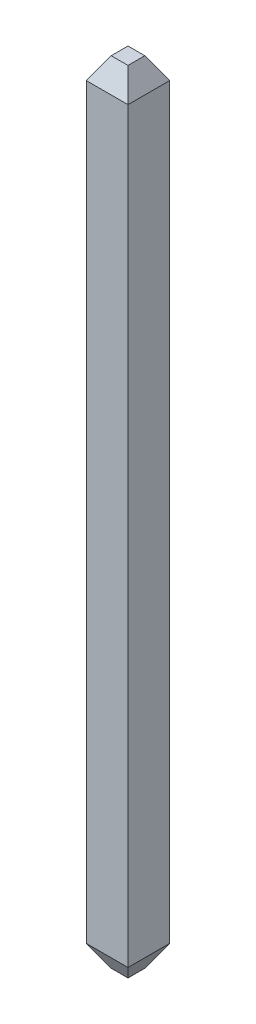
ISO-10303-21;
HEADER;
FILE_DESCRIPTION(('STEP AP214'),'2;1');
FILE_NAME('part.step','',(''),(''),'','','');
FILE_SCHEMA(('AUTOMOTIVE_DESIGN { 1 0 10303 214 1 1 1 1 }'));
ENDSEC;
DATA;
#1=APPLICATION_CONTEXT('core data for automotive mechanical design processes');
#2=APPLICATION_PROTOCOL_DEFINITION('international standard','automotive_design',2000,#1);
#3=PRODUCT_CONTEXT('',#1,'mechanical');
#4=PRODUCT('Part','Part','',(#3));
#5=PRODUCT_RELATED_PRODUCT_CATEGORY('part','',(#4));
#6=PRODUCT_DEFINITION_FORMATION('','',#4);
#7=PRODUCT_DEFINITION_CONTEXT('part definition',#1,'design');
#8=PRODUCT_DEFINITION('design','',#6,#7);
#9=PRODUCT_DEFINITION_SHAPE('','',#8);
#10=(LENGTH_UNIT() NAMED_UNIT(*) SI_UNIT(.MILLI.,.METRE.));
#11=(NAMED_UNIT(*) PLANE_ANGLE_UNIT() SI_UNIT($,.RADIAN.));
#12=(NAMED_UNIT(*) SI_UNIT($,.STERADIAN.) SOLID_ANGLE_UNIT());
#13=UNCERTAINTY_MEASURE_WITH_UNIT(LENGTH_MEASURE(1.E-05),#10,'distance_accuracy_value','');
#14=(GEOMETRIC_REPRESENTATION_CONTEXT(3) GLOBAL_UNCERTAINTY_ASSIGNED_CONTEXT((#13)) GLOBAL_UNIT_ASSIGNED_CONTEXT((#10,
#11,#12)) REPRESENTATION_CONTEXT('',''));
#15=CARTESIAN_POINT('',(0.,0.,0.));
#16=DIRECTION('',(0.,0.,1.));
#17=DIRECTION('',(1.,0.,0.));
#18=AXIS2_PLACEMENT_3D('',#15,#16,#17);
#19=CARTESIAN_POINT('',(-0.135,12.7,0.));
#20=DIRECTION('',(-0.86602540378444,0.499999999999998,0.));
#21=DIRECTION('',(-0.499999999999998,-0.86602540378444,0.));
#22=AXIS2_PLACEMENT_3D('',#19,#20,#21);
#23=PLANE('',#22);
#24=DIRECTION('',(-0.447213595499957,-0.774596669241485,0.447213595499957));
#25=VECTOR('',#24,1.);
#26=CARTESIAN_POINT('',(-0.135,12.7,0.135));
#27=LINE('',#26,#25);
#28=CARTESIAN_POINT('',(-0.135,12.7,0.135));
#29=VERTEX_POINT('',#28);
#30=CARTESIAN_POINT('',(-0.335,12.3535898384862,0.335));
#31=VERTEX_POINT('',#30);
#32=EDGE_CURVE('E95',#29,#31,#27,.T.);
#33=ORIENTED_EDGE('',*,*,#32,.F.);
#34=DIRECTION('',(0.,0.,1.));
#35=VECTOR('',#34,1.);
#36=CARTESIAN_POINT('',(-0.135,12.7,0.));
#37=LINE('',#36,#35);
#38=CARTESIAN_POINT('',(-0.135,12.7,-0.135));
#39=VERTEX_POINT('',#38);
#40=EDGE_CURVE('E19',#39,#29,#37,.T.);
#41=ORIENTED_EDGE('',*,*,#40,.F.);
#42=DIRECTION('',(0.447213595499957,0.774596669241485,0.447213595499957));
#43=VECTOR('',#42,1.);
#44=CARTESIAN_POINT('',(-0.335,12.3535898384862,-0.335));
#45=LINE('',#44,#43);
#46=CARTESIAN_POINT('',(-0.335,12.3535898384862,-0.335));
#47=VERTEX_POINT('',#46);
#48=EDGE_CURVE('E83',#47,#39,#45,.T.);
#49=ORIENTED_EDGE('',*,*,#48,.F.);
#50=DIRECTION('',(0.,0.,-1.));
#51=VECTOR('',#50,1.);
#52=CARTESIAN_POINT('',(-0.335,12.3535898384862,-0.335));
#53=LINE('',#52,#51);
#54=EDGE_CURVE('E119',#47,#31,#53,.F.);
#55=ORIENTED_EDGE('',*,*,#54,.T.);
#56=EDGE_LOOP('',(#33,#41,#49,#55));
#57=FACE_BOUND('',#56,.T.);
#58=ADVANCED_FACE('F16',(#57),#23,.T.);
#59=CARTESIAN_POINT('',(-0.335,0.346410161513776,-0.335));
#60=DIRECTION('',(0.866025403784439,0.5,0.));
#61=DIRECTION('',(-0.5,0.866025403784439,0.));
#62=AXIS2_PLACEMENT_3D('',#59,#60,#61);
#63=PLANE('',#62);
#64=DIRECTION('',(0.,0.,-1.));
#65=VECTOR('',#64,1.);
#66=CARTESIAN_POINT('',(-0.335,0.346410161513776,-0.335));
#67=LINE('',#66,#65);
#68=CARTESIAN_POINT('',(-0.335,0.346410161513777,0.335));
#69=VERTEX_POINT('',#68);
#70=CARTESIAN_POINT('',(-0.335,0.346410161513776,-0.335));
#71=VERTEX_POINT('',#70);
#72=EDGE_CURVE('E121',#69,#71,#67,.T.);
#73=ORIENTED_EDGE('',*,*,#72,.T.);
#74=DIRECTION('',(0.447213595499958,-0.774596669241483,0.447213595499958));
#75=VECTOR('',#74,1.);
#76=CARTESIAN_POINT('',(-0.335,0.346410161513776,-0.335));
#77=LINE('',#76,#75);
#78=CARTESIAN_POINT('',(-0.134999999999999,0.,-0.135));
#79=VERTEX_POINT('',#78);
#80=EDGE_CURVE('E77',#71,#79,#77,.T.);
#81=ORIENTED_EDGE('',*,*,#80,.T.);
#82=DIRECTION('',(0.,0.,1.));
#83=VECTOR('',#82,1.);
#84=CARTESIAN_POINT('',(-0.135,0.,0.));
#85=LINE('',#84,#83);
#86=CARTESIAN_POINT('',(-0.134999999999999,0.,0.134999999999999));
#87=VERTEX_POINT('',#86);
#88=EDGE_CURVE('E108',#79,#87,#85,.T.);
#89=ORIENTED_EDGE('',*,*,#88,.T.);
#90=DIRECTION('',(-0.447213595499958,0.774596669241484,0.447213595499958));
#91=VECTOR('',#90,1.);
#92=CARTESIAN_POINT('',(-0.134999999999999,0.,0.134999999999999));
#93=LINE('',#92,#91);
#94=EDGE_CURVE('E116',#87,#69,#93,.T.);
#95=ORIENTED_EDGE('',*,*,#94,.T.);
#96=EDGE_LOOP('',(#73,#81,#89,#95));
#97=FACE_BOUND('',#96,.T.);
#98=ADVANCED_FACE('F212',(#97),#63,.F.);
#99=CARTESIAN_POINT('',(0.,12.7,0.));
#100=DIRECTION('',(0.,1.,0.));
#101=DIRECTION('',(0.,0.,1.));
#102=AXIS2_PLACEMENT_3D('',#99,#100,#101);
#103=PLANE('',#102);
#104=DIRECTION('',(0.,0.,1.));
#105=VECTOR('',#104,1.);
#106=CARTESIAN_POINT('',(0.135,12.7,0.));
#107=LINE('',#106,#105);
#108=CARTESIAN_POINT('',(0.135,12.7,-0.135));
#109=VERTEX_POINT('',#108);
#110=CARTESIAN_POINT('',(0.135,12.7,0.135));
#111=VERTEX_POINT('',#110);
#112=EDGE_CURVE('E101',#109,#111,#107,.T.);
#113=ORIENTED_EDGE('',*,*,#112,.F.);
#114=DIRECTION('',(1.,0.,0.));
#115=VECTOR('',#114,1.);
#116=CARTESIAN_POINT('',(0.,12.7,-0.135));
#117=LINE('',#116,#115);
#118=EDGE_CURVE('E88',#39,#109,#117,.T.);
#119=ORIENTED_EDGE('',*,*,#118,.F.);
#120=ORIENTED_EDGE('',*,*,#40,.T.);
#121=DIRECTION('',(1.,0.,0.));
#122=VECTOR('',#121,1.);
#123=CARTESIAN_POINT('',(0.,12.7,0.135));
#124=LINE('',#123,#122);
#125=EDGE_CURVE('E111',#111,#29,#124,.F.);
#126=ORIENTED_EDGE('',*,*,#125,.F.);
#127=EDGE_LOOP('',(#113,#119,#120,#126));
#128=FACE_BOUND('',#127,.T.);
#129=ADVANCED_FACE('F100',(#128),#103,.T.);
#130=CARTESIAN_POINT('',(0.,12.7,-0.135));
#131=DIRECTION('',(0.,0.499999999999998,-0.86602540378444));
#132=DIRECTION('',(0.,0.86602540378444,0.499999999999998));
#133=AXIS2_PLACEMENT_3D('',#130,#131,#132);
#134=PLANE('',#133);
#135=ORIENTED_EDGE('',*,*,#48,.T.);
#136=ORIENTED_EDGE('',*,*,#118,.T.);
#137=DIRECTION('',(-0.447213595499957,0.774596669241485,0.447213595499957));
#138=VECTOR('',#137,1.);
#139=CARTESIAN_POINT('',(0.335,12.3535898384862,-0.335));
#140=LINE('',#139,#138);
#141=CARTESIAN_POINT('',(0.335,12.3535898384862,-0.335));
#142=VERTEX_POINT('',#141);
#143=EDGE_CURVE('E123',#142,#109,#140,.T.);
#144=ORIENTED_EDGE('',*,*,#143,.F.);
#145=DIRECTION('',(1.,0.,0.));
#146=VECTOR('',#145,1.);
#147=CARTESIAN_POINT('',(-0.335,12.3535898384862,-0.335));
#148=LINE('',#147,#146);
#149=EDGE_CURVE('E90',#142,#47,#148,.F.);
#150=ORIENTED_EDGE('',*,*,#149,.T.);
#151=EDGE_LOOP('',(#135,#136,#144,#150));
#152=FACE_BOUND('',#151,.T.);
#153=ADVANCED_FACE('F85',(#152),#134,.T.);
#154=CARTESIAN_POINT('',(-0.335,0.346410161513776,-0.335));
#155=DIRECTION('',(0.,0.5,0.866025403784439));
#156=DIRECTION('',(0.,-0.866025403784439,0.5));
#157=AXIS2_PLACEMENT_3D('',#154,#155,#156);
#158=PLANE('',#157);
#159=DIRECTION('',(1.,0.,0.));
#160=VECTOR('',#159,1.);
#161=CARTESIAN_POINT('',(0.,0.,-0.135));
#162=LINE('',#161,#160);
#163=CARTESIAN_POINT('',(0.134999999999999,0.,-0.135));
#164=VERTEX_POINT('',#163);
#165=EDGE_CURVE('E103',#164,#79,#162,.F.);
#166=ORIENTED_EDGE('',*,*,#165,.T.);
#167=ORIENTED_EDGE('',*,*,#80,.F.);
#168=DIRECTION('',(1.,0.,0.));
#169=VECTOR('',#168,1.);
#170=CARTESIAN_POINT('',(-0.335,0.346410161513776,-0.335));
#171=LINE('',#170,#169);
#172=CARTESIAN_POINT('',(0.335,0.346410161513776,-0.335));
#173=VERTEX_POINT('',#172);
#174=EDGE_CURVE('E132',#71,#173,#171,.T.);
#175=ORIENTED_EDGE('',*,*,#174,.T.);
#176=DIRECTION('',(-0.447213595499958,-0.774596669241484,0.447213595499958));
#177=VECTOR('',#176,1.);
#178=CARTESIAN_POINT('',(0.335,0.346410161513776,-0.335));
#179=LINE('',#178,#177);
#180=EDGE_CURVE('E135',#173,#164,#179,.T.);
#181=ORIENTED_EDGE('',*,*,#180,.T.);
#182=EDGE_LOOP('',(#166,#167,#175,#181));
#183=FACE_BOUND('',#182,.T.);
#184=ADVANCED_FACE('F204',(#183),#158,.F.);
#185=CARTESIAN_POINT('',(0.,0.,0.));
#186=DIRECTION('',(0.,1.,0.));
#187=DIRECTION('',(0.,0.,1.));
#188=AXIS2_PLACEMENT_3D('',#185,#186,#187);
#189=PLANE('',#188);
#190=ORIENTED_EDGE('',*,*,#165,.F.);
#191=DIRECTION('',(0.,0.,1.));
#192=VECTOR('',#191,1.);
#193=CARTESIAN_POINT('',(0.134999999999999,0.,-0.335));
#194=LINE('',#193,#192);
#195=CARTESIAN_POINT('',(0.134999999999999,0.,0.134999999999999));
#196=VERTEX_POINT('',#195);
#197=EDGE_CURVE('E138',#164,#196,#194,.T.);
#198=ORIENTED_EDGE('',*,*,#197,.T.);
#199=DIRECTION('',(1.,0.,0.));
#200=VECTOR('',#199,1.);
#201=CARTESIAN_POINT('',(-0.335,0.,0.134999999999999));
#202=LINE('',#201,#200);
#203=EDGE_CURVE('E113',#196,#87,#202,.F.);
#204=ORIENTED_EDGE('',*,*,#203,.T.);
#205=ORIENTED_EDGE('',*,*,#88,.F.);
#206=EDGE_LOOP('',(#190,#198,#204,#205));
#207=FACE_BOUND('',#206,.T.);
#208=ADVANCED_FACE('F201',(#207),#189,.F.);
#209=CARTESIAN_POINT('',(0.,12.7,0.135));
#210=DIRECTION('',(0.,0.499999999999998,0.86602540378444));
#211=DIRECTION('',(0.,-0.86602540378444,0.499999999999998));
#212=AXIS2_PLACEMENT_3D('',#209,#210,#211);
#213=PLANE('',#212);
#214=DIRECTION('',(0.447213595499957,-0.774596669241485,0.447213595499957));
#215=VECTOR('',#214,1.);
#216=CARTESIAN_POINT('',(0.135,12.7,0.135));
#217=LINE('',#216,#215);
#218=CARTESIAN_POINT('',(0.335,12.3535898384862,0.335));
#219=VERTEX_POINT('',#218);
#220=EDGE_CURVE('E126',#111,#219,#217,.T.);
#221=ORIENTED_EDGE('',*,*,#220,.F.);
#222=ORIENTED_EDGE('',*,*,#125,.T.);
#223=ORIENTED_EDGE('',*,*,#32,.T.);
#224=DIRECTION('',(-1.,0.,0.));
#225=VECTOR('',#224,1.);
#226=CARTESIAN_POINT('',(-0.335,12.3535898384862,0.335));
#227=LINE('',#226,#225);
#228=EDGE_CURVE('E143',#31,#219,#227,.F.);
#229=ORIENTED_EDGE('',*,*,#228,.T.);
#230=EDGE_LOOP('',(#221,#222,#223,#229));
#231=FACE_BOUND('',#230,.T.);
#232=ADVANCED_FACE('F175',(#231),#213,.T.);
#233=CARTESIAN_POINT('',(-0.335,0.346410161513776,0.335));
#234=DIRECTION('',(0.,0.5,-0.866025403784439));
#235=DIRECTION('',(0.,0.866025403784439,0.5));
#236=AXIS2_PLACEMENT_3D('',#233,#234,#235);
#237=PLANE('',#236);
#238=ORIENTED_EDGE('',*,*,#203,.F.);
#239=DIRECTION('',(0.447213595499958,0.774596669241484,0.447213595499958));
#240=VECTOR('',#239,1.);
#241=CARTESIAN_POINT('',(0.135,0.,0.134999999999999));
#242=LINE('',#241,#240);
#243=CARTESIAN_POINT('',(0.335,0.346410161513777,0.335));
#244=VERTEX_POINT('',#243);
#245=EDGE_CURVE('E141',#196,#244,#242,.T.);
#246=ORIENTED_EDGE('',*,*,#245,.T.);
#247=DIRECTION('',(-1.,0.,0.));
#248=VECTOR('',#247,1.);
#249=CARTESIAN_POINT('',(-0.335,0.346410161513776,0.335));
#250=LINE('',#249,#248);
#251=EDGE_CURVE('E33',#244,#69,#250,.T.);
#252=ORIENTED_EDGE('',*,*,#251,.T.);
#253=ORIENTED_EDGE('',*,*,#94,.F.);
#254=EDGE_LOOP('',(#238,#246,#252,#253));
#255=FACE_BOUND('',#254,.T.);
#256=ADVANCED_FACE('F194',(#255),#237,.F.);
#257=CARTESIAN_POINT('',(-0.335,12.7,-0.335));
#258=DIRECTION('',(1.,0.,0.));
#259=DIRECTION('',(0.,0.,-1.));
#260=AXIS2_PLACEMENT_3D('',#257,#258,#259);
#261=PLANE('',#260);
#262=ORIENTED_EDGE('',*,*,#72,.F.);
#263=DIRECTION('',(0.,1.,0.));
#264=VECTOR('',#263,1.);
#265=CARTESIAN_POINT('',(-0.335,12.7,0.335));
#266=LINE('',#265,#264);
#267=EDGE_CURVE('E147',#69,#31,#266,.T.);
#268=ORIENTED_EDGE('',*,*,#267,.T.);
#269=ORIENTED_EDGE('',*,*,#54,.F.);
#270=DIRECTION('',(0.,1.,0.));
#271=VECTOR('',#270,1.);
#272=CARTESIAN_POINT('',(-0.335,12.7,-0.335));
#273=LINE('',#272,#271);
#274=EDGE_CURVE('E129',#47,#71,#273,.F.);
#275=ORIENTED_EDGE('',*,*,#274,.T.);
#276=EDGE_LOOP('',(#262,#268,#269,#275));
#277=FACE_BOUND('',#276,.T.);
#278=ADVANCED_FACE('F191',(#277),#261,.F.);
#279=CARTESIAN_POINT('',(0.135,12.7,0.));
#280=DIRECTION('',(0.86602540378444,0.499999999999998,0.));
#281=DIRECTION('',(-0.499999999999998,0.86602540378444,0.));
#282=AXIS2_PLACEMENT_3D('',#279,#280,#281);
#283=PLANE('',#282);
#284=ORIENTED_EDGE('',*,*,#220,.T.);
#285=DIRECTION('',(0.,0.,1.));
#286=VECTOR('',#285,1.);
#287=CARTESIAN_POINT('',(0.335,12.3535898384862,-0.335));
#288=LINE('',#287,#286);
#289=EDGE_CURVE('E150',#219,#142,#288,.F.);
#290=ORIENTED_EDGE('',*,*,#289,.T.);
#291=ORIENTED_EDGE('',*,*,#143,.T.);
#292=ORIENTED_EDGE('',*,*,#112,.T.);
#293=EDGE_LOOP('',(#284,#290,#291,#292));
#294=FACE_BOUND('',#293,.T.);
#295=ADVANCED_FACE('F171',(#294),#283,.T.);
#296=CARTESIAN_POINT('',(-0.335,12.7,-0.335));
#297=DIRECTION('',(0.,0.,1.));
#298=DIRECTION('',(1.,0.,0.));
#299=AXIS2_PLACEMENT_3D('',#296,#297,#298);
#300=PLANE('',#299);
#301=ORIENTED_EDGE('',*,*,#174,.F.);
#302=ORIENTED_EDGE('',*,*,#274,.F.);
#303=ORIENTED_EDGE('',*,*,#149,.F.);
#304=DIRECTION('',(0.,1.,0.));
#305=VECTOR('',#304,1.);
#306=CARTESIAN_POINT('',(0.335,12.7,-0.335));
#307=LINE('',#306,#305);
#308=EDGE_CURVE('E153',#142,#173,#307,.F.);
#309=ORIENTED_EDGE('',*,*,#308,.T.);
#310=EDGE_LOOP('',(#301,#302,#303,#309));
#311=FACE_BOUND('',#310,.T.);
#312=ADVANCED_FACE('F169',(#311),#300,.F.);
#313=CARTESIAN_POINT('',(0.335,0.346410161513776,-0.335));
#314=DIRECTION('',(-0.866025403784439,0.5,0.));
#315=DIRECTION('',(-0.5,-0.866025403784439,0.));
#316=AXIS2_PLACEMENT_3D('',#313,#314,#315);
#317=PLANE('',#316);
#318=ORIENTED_EDGE('',*,*,#197,.F.);
#319=ORIENTED_EDGE('',*,*,#180,.F.);
#320=DIRECTION('',(0.,0.,1.));
#321=VECTOR('',#320,1.);
#322=CARTESIAN_POINT('',(0.335,0.346410161513776,-0.335));
#323=LINE('',#322,#321);
#324=EDGE_CURVE('E25',#173,#244,#323,.T.);
#325=ORIENTED_EDGE('',*,*,#324,.T.);
#326=ORIENTED_EDGE('',*,*,#245,.F.);
#327=EDGE_LOOP('',(#318,#319,#325,#326));
#328=FACE_BOUND('',#327,.T.);
#329=ADVANCED_FACE('F161',(#328),#317,.F.);
#330=CARTESIAN_POINT('',(-0.335,12.7,0.335));
#331=DIRECTION('',(0.,0.,-1.));
#332=DIRECTION('',(-1.,0.,0.));
#333=AXIS2_PLACEMENT_3D('',#330,#331,#332);
#334=PLANE('',#333);
#335=ORIENTED_EDGE('',*,*,#251,.F.);
#336=DIRECTION('',(0.,1.,0.));
#337=VECTOR('',#336,1.);
#338=CARTESIAN_POINT('',(0.335,12.7,0.335));
#339=LINE('',#338,#337);
#340=EDGE_CURVE('E10',#244,#219,#339,.T.);
#341=ORIENTED_EDGE('',*,*,#340,.T.);
#342=ORIENTED_EDGE('',*,*,#228,.F.);
#343=ORIENTED_EDGE('',*,*,#267,.F.);
#344=EDGE_LOOP('',(#335,#341,#342,#343));
#345=FACE_BOUND('',#344,.T.);
#346=ADVANCED_FACE('F176',(#345),#334,.F.);
#347=CARTESIAN_POINT('',(0.335,12.7,-0.335));
#348=DIRECTION('',(-1.,0.,0.));
#349=DIRECTION('',(0.,0.,1.));
#350=AXIS2_PLACEMENT_3D('',#347,#348,#349);
#351=PLANE('',#350);
#352=ORIENTED_EDGE('',*,*,#324,.F.);
#353=ORIENTED_EDGE('',*,*,#308,.F.);
#354=ORIENTED_EDGE('',*,*,#289,.F.);
#355=ORIENTED_EDGE('',*,*,#340,.F.);
#356=EDGE_LOOP('',(#352,#353,#354,#355));
#357=FACE_BOUND('',#356,.T.);
#358=ADVANCED_FACE('F165',(#357),#351,.F.);
#359=CLOSED_SHELL('',(#58,#98,#129,#153,#184,#208,#232,#256,#278,#295,#312,#329,#346,#358));
#360=MANIFOLD_SOLID_BREP('B1',#359);
#361=ADVANCED_BREP_SHAPE_REPRESENTATION('',(#18,#360),#14);
#362=SHAPE_DEFINITION_REPRESENTATION(#9,#361);
ENDSEC;
END-ISO-10303-21;
